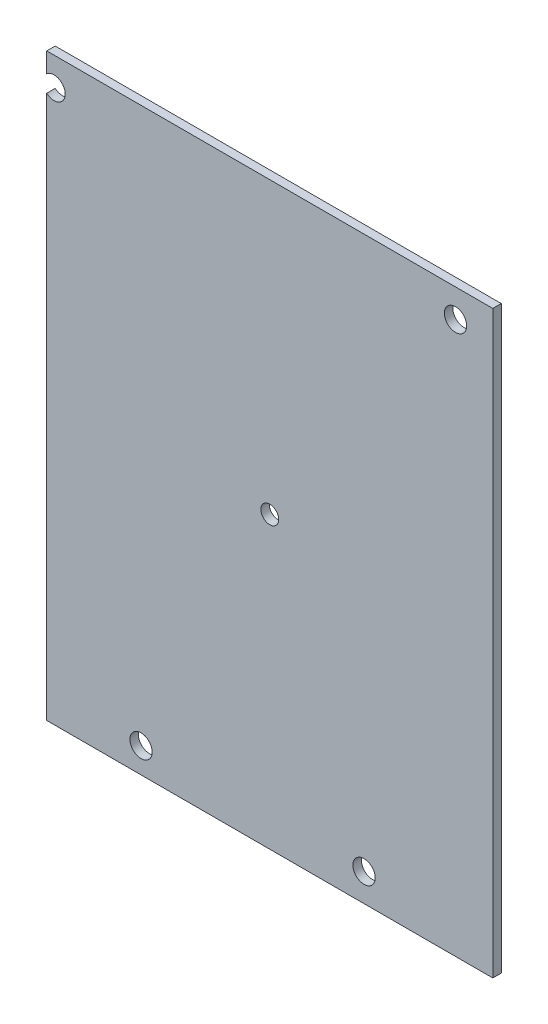
ISO-10303-21;
HEADER;
FILE_DESCRIPTION(('STEP AP214'),'2;1');
FILE_NAME('part.step','',(''),(''),'','','');
FILE_SCHEMA(('AUTOMOTIVE_DESIGN { 1 0 10303 214 1 1 1 1 }'));
ENDSEC;
DATA;
#1=APPLICATION_CONTEXT('core data for automotive mechanical design processes');
#2=APPLICATION_PROTOCOL_DEFINITION('international standard','automotive_design',2000,#1);
#3=PRODUCT_CONTEXT('',#1,'mechanical');
#4=PRODUCT('Part','Part','',(#3));
#5=PRODUCT_RELATED_PRODUCT_CATEGORY('part','',(#4));
#6=PRODUCT_DEFINITION_FORMATION('','',#4);
#7=PRODUCT_DEFINITION_CONTEXT('part definition',#1,'design');
#8=PRODUCT_DEFINITION('design','',#6,#7);
#9=PRODUCT_DEFINITION_SHAPE('','',#8);
#10=(LENGTH_UNIT() NAMED_UNIT(*) SI_UNIT(.MILLI.,.METRE.));
#11=(NAMED_UNIT(*) PLANE_ANGLE_UNIT() SI_UNIT($,.RADIAN.));
#12=(NAMED_UNIT(*) SI_UNIT($,.STERADIAN.) SOLID_ANGLE_UNIT());
#13=UNCERTAINTY_MEASURE_WITH_UNIT(LENGTH_MEASURE(1.E-05),#10,'distance_accuracy_value','');
#14=(GEOMETRIC_REPRESENTATION_CONTEXT(3) GLOBAL_UNCERTAINTY_ASSIGNED_CONTEXT((#13)) GLOBAL_UNIT_ASSIGNED_CONTEXT((#10,
#11,#12)) REPRESENTATION_CONTEXT('',''));
#15=CARTESIAN_POINT('',(0.,0.,0.));
#16=DIRECTION('',(0.,0.,1.));
#17=DIRECTION('',(1.,0.,0.));
#18=AXIS2_PLACEMENT_3D('',#15,#16,#17);
#19=CARTESIAN_POINT('',(0.,0.,-1.89738));
#20=DIRECTION('',(0.,0.,1.));
#21=DIRECTION('',(1.,0.,0.));
#22=AXIS2_PLACEMENT_3D('',#19,#20,#21);
#23=PLANE('',#22);
#24=CARTESIAN_POINT('',(-14.6334496466707,-49.8264548686527,-1.89738));
#25=DIRECTION('',(0.,0.,1.));
#26=DIRECTION('',(1.,0.,0.));
#27=AXIS2_PLACEMENT_3D('',#24,#25,#26);
#28=CIRCLE('',#27,2.5);
#29=CARTESIAN_POINT('',(-12.1334496466707,-49.8264548686527,-1.89738));
#30=VERTEX_POINT('',#29);
#31=EDGE_CURVE('E151',#30,#30,#28,.T.);
#32=ORIENTED_EDGE('',*,*,#31,.T.);
#33=EDGE_LOOP('',(#32));
#34=FACE_BOUND('',#33,.T.);
#35=CARTESIAN_POINT('',(55.8665503533293,68.1735451313474,-1.89738));
#36=DIRECTION('',(0.,0.,1.));
#37=DIRECTION('',(1.,0.,0.));
#38=AXIS2_PLACEMENT_3D('',#35,#36,#37);
#39=CIRCLE('',#38,2.5);
#40=CARTESIAN_POINT('',(58.3665503533293,68.1735451313474,-1.89738));
#41=VERTEX_POINT('',#40);
#42=EDGE_CURVE('E140',#41,#41,#39,.T.);
#43=ORIENTED_EDGE('',*,*,#42,.T.);
#44=EDGE_LOOP('',(#43));
#45=FACE_BOUND('',#44,.T.);
#46=CARTESIAN_POINT('',(-34.1334496466707,68.1735451313474,-1.89738));
#47=DIRECTION('',(0.,0.,1.));
#48=DIRECTION('',(1.,0.,0.));
#49=AXIS2_PLACEMENT_3D('',#46,#47,#48);
#50=CIRCLE('',#49,2.5);
#51=CARTESIAN_POINT('',(-35.7776059019718,66.2902633658768,-1.89738));
#52=VERTEX_POINT('',#51);
#53=CARTESIAN_POINT('',(-35.7776059019718,70.0568268968181,-1.89738));
#54=VERTEX_POINT('',#53);
#55=EDGE_CURVE('E102',#52,#54,#50,.T.);
#56=ORIENTED_EDGE('',*,*,#55,.T.);
#57=DIRECTION('',(0.,-1.,0.));
#58=VECTOR('',#57,1.);
#59=CARTESIAN_POINT('',(-35.7776059019718,74.5093800668341,-1.89738));
#60=LINE('',#59,#58);
#61=CARTESIAN_POINT('',(-35.7776059019718,74.5093800668341,-1.89738));
#62=VERTEX_POINT('',#61);
#63=EDGE_CURVE('E107',#62,#54,#60,.T.);
#64=ORIENTED_EDGE('',*,*,#63,.F.);
#65=DIRECTION('',(-1.,0.,0.));
#66=VECTOR('',#65,1.);
#67=CARTESIAN_POINT('',(-35.7776059019718,74.5093800668341,-1.89738));
#68=LINE('',#67,#66);
#69=CARTESIAN_POINT('',(64.2223940980282,74.5093800668341,-1.89738));
#70=VERTEX_POINT('',#69);
#71=EDGE_CURVE('E120',#70,#62,#68,.T.);
#72=ORIENTED_EDGE('',*,*,#71,.F.);
#73=DIRECTION('',(0.,1.,0.));
#74=VECTOR('',#73,1.);
#75=CARTESIAN_POINT('',(64.2223940980282,74.5093800668341,-1.89738));
#76=LINE('',#75,#74);
#77=CARTESIAN_POINT('',(64.2223940980282,-55.4906199331659,-1.89738));
#78=VERTEX_POINT('',#77);
#79=EDGE_CURVE('E130',#78,#70,#76,.T.);
#80=ORIENTED_EDGE('',*,*,#79,.F.);
#81=DIRECTION('',(1.,0.,0.));
#82=VECTOR('',#81,1.);
#83=CARTESIAN_POINT('',(-35.7776059019718,-55.4906199331659,-1.89738));
#84=LINE('',#83,#82);
#85=CARTESIAN_POINT('',(-35.7776059019718,-55.4906199331659,-1.89738));
#86=VERTEX_POINT('',#85);
#87=EDGE_CURVE('E133',#86,#78,#84,.T.);
#88=ORIENTED_EDGE('',*,*,#87,.F.);
#89=EDGE_CURVE('E85',#52,#86,#60,.T.);
#90=ORIENTED_EDGE('',*,*,#89,.F.);
#91=EDGE_LOOP('',(#56,#64,#72,#80,#88,#90));
#92=FACE_BOUND('',#91,.T.);
#93=CARTESIAN_POINT('',(35.3631866927861,-49.246493887115,-1.89738));
#94=DIRECTION('',(0.,0.,1.));
#95=DIRECTION('',(1.,0.,0.));
#96=AXIS2_PLACEMENT_3D('',#93,#94,#95);
#97=CIRCLE('',#96,2.5);
#98=CARTESIAN_POINT('',(37.8631866927861,-49.246493887115,-1.89738));
#99=VERTEX_POINT('',#98);
#100=EDGE_CURVE('E145',#99,#99,#97,.T.);
#101=ORIENTED_EDGE('',*,*,#100,.T.);
#102=EDGE_LOOP('',(#101));
#103=FACE_BOUND('',#102,.T.);
#104=CARTESIAN_POINT('',(14.2223940980282,9.50938006683406,-1.89738));
#105=DIRECTION('',(0.,0.,1.));
#106=DIRECTION('',(1.,0.,0.));
#107=AXIS2_PLACEMENT_3D('',#104,#105,#106);
#108=CIRCLE('',#107,2.);
#109=CARTESIAN_POINT('',(16.2223940980282,9.50938006683406,-1.89738));
#110=VERTEX_POINT('',#109);
#111=EDGE_CURVE('E157',#110,#110,#108,.T.);
#112=ORIENTED_EDGE('',*,*,#111,.T.);
#113=EDGE_LOOP('',(#112));
#114=FACE_BOUND('',#113,.T.);
#115=ADVANCED_FACE('F35',(#34,#45,#92,#103,#114),#23,.F.);
#116=CARTESIAN_POINT('',(0.,0.,0.));
#117=DIRECTION('',(0.,0.,1.));
#118=DIRECTION('',(1.,0.,0.));
#119=AXIS2_PLACEMENT_3D('',#116,#117,#118);
#120=PLANE('',#119);
#121=CARTESIAN_POINT('',(-14.6334496466707,-49.8264548686527,0.));
#122=DIRECTION('',(0.,0.,1.));
#123=DIRECTION('',(1.,0.,0.));
#124=AXIS2_PLACEMENT_3D('',#121,#122,#123);
#125=CIRCLE('',#124,2.5);
#126=CARTESIAN_POINT('',(-12.1334496466707,-49.8264548686527,0.));
#127=VERTEX_POINT('',#126);
#128=EDGE_CURVE('E154',#127,#127,#125,.T.);
#129=ORIENTED_EDGE('',*,*,#128,.F.);
#130=EDGE_LOOP('',(#129));
#131=FACE_BOUND('',#130,.T.);
#132=CARTESIAN_POINT('',(55.8665503533293,68.1735451313474,0.));
#133=DIRECTION('',(0.,0.,1.));
#134=DIRECTION('',(1.,0.,0.));
#135=AXIS2_PLACEMENT_3D('',#132,#133,#134);
#136=CIRCLE('',#135,2.5);
#137=CARTESIAN_POINT('',(58.3665503533293,68.1735451313474,0.));
#138=VERTEX_POINT('',#137);
#139=EDGE_CURVE('E142',#138,#138,#136,.T.);
#140=ORIENTED_EDGE('',*,*,#139,.F.);
#141=EDGE_LOOP('',(#140));
#142=FACE_BOUND('',#141,.T.);
#143=DIRECTION('',(0.,-1.,0.));
#144=VECTOR('',#143,1.);
#145=CARTESIAN_POINT('',(-35.7776059019718,74.5093800668341,0.));
#146=LINE('',#145,#144);
#147=CARTESIAN_POINT('',(-35.7776059019718,74.5093800668341,0.));
#148=VERTEX_POINT('',#147);
#149=CARTESIAN_POINT('',(-35.7776059019718,70.0568268968181,0.));
#150=VERTEX_POINT('',#149);
#151=EDGE_CURVE('E105',#148,#150,#146,.T.);
#152=ORIENTED_EDGE('',*,*,#151,.T.);
#153=CARTESIAN_POINT('',(-34.1334496466707,68.1735451313474,0.));
#154=DIRECTION('',(0.,0.,1.));
#155=DIRECTION('',(1.,0.,0.));
#156=AXIS2_PLACEMENT_3D('',#153,#154,#155);
#157=CIRCLE('',#156,2.5);
#158=CARTESIAN_POINT('',(-35.7776059019718,66.2902633658768,0.));
#159=VERTEX_POINT('',#158);
#160=EDGE_CURVE('E94',#159,#150,#157,.T.);
#161=ORIENTED_EDGE('',*,*,#160,.F.);
#162=CARTESIAN_POINT('',(-35.7776059019718,-55.4906199331659,0.));
#163=VERTEX_POINT('',#162);
#164=EDGE_CURVE('E108',#159,#163,#146,.T.);
#165=ORIENTED_EDGE('',*,*,#164,.T.);
#166=DIRECTION('',(1.,0.,0.));
#167=VECTOR('',#166,1.);
#168=CARTESIAN_POINT('',(-35.7776059019718,-55.4906199331659,0.));
#169=LINE('',#168,#167);
#170=CARTESIAN_POINT('',(64.2223940980282,-55.4906199331659,0.));
#171=VERTEX_POINT('',#170);
#172=EDGE_CURVE('E114',#163,#171,#169,.T.);
#173=ORIENTED_EDGE('',*,*,#172,.T.);
#174=DIRECTION('',(0.,1.,0.));
#175=VECTOR('',#174,1.);
#176=CARTESIAN_POINT('',(64.2223940980282,74.5093800668341,0.));
#177=LINE('',#176,#175);
#178=CARTESIAN_POINT('',(64.2223940980282,74.5093800668341,0.));
#179=VERTEX_POINT('',#178);
#180=EDGE_CURVE('E117',#171,#179,#177,.T.);
#181=ORIENTED_EDGE('',*,*,#180,.T.);
#182=DIRECTION('',(-1.,0.,0.));
#183=VECTOR('',#182,1.);
#184=CARTESIAN_POINT('',(-35.7776059019718,74.5093800668341,0.));
#185=LINE('',#184,#183);
#186=EDGE_CURVE('E113',#179,#148,#185,.T.);
#187=ORIENTED_EDGE('',*,*,#186,.T.);
#188=EDGE_LOOP('',(#152,#161,#165,#173,#181,#187));
#189=FACE_BOUND('',#188,.T.);
#190=CARTESIAN_POINT('',(35.3631866927861,-49.246493887115,0.));
#191=DIRECTION('',(0.,0.,1.));
#192=DIRECTION('',(1.,0.,0.));
#193=AXIS2_PLACEMENT_3D('',#190,#191,#192);
#194=CIRCLE('',#193,2.5);
#195=CARTESIAN_POINT('',(37.8631866927861,-49.246493887115,0.));
#196=VERTEX_POINT('',#195);
#197=EDGE_CURVE('E148',#196,#196,#194,.T.);
#198=ORIENTED_EDGE('',*,*,#197,.F.);
#199=EDGE_LOOP('',(#198));
#200=FACE_BOUND('',#199,.T.);
#201=CARTESIAN_POINT('',(14.2223940980282,9.50938006683406,0.));
#202=DIRECTION('',(0.,0.,1.));
#203=DIRECTION('',(1.,0.,0.));
#204=AXIS2_PLACEMENT_3D('',#201,#202,#203);
#205=CIRCLE('',#204,2.);
#206=CARTESIAN_POINT('',(16.2223940980282,9.50938006683406,0.));
#207=VERTEX_POINT('',#206);
#208=EDGE_CURVE('E160',#207,#207,#205,.T.);
#209=ORIENTED_EDGE('',*,*,#208,.F.);
#210=EDGE_LOOP('',(#209));
#211=FACE_BOUND('',#210,.T.);
#212=ADVANCED_FACE('F110',(#131,#142,#189,#200,#211),#120,.T.);
#213=CARTESIAN_POINT('',(-35.7776059019718,74.5093800668341,-1.89738));
#214=DIRECTION('',(-1.,0.,0.));
#215=DIRECTION('',(0.,-1.,0.));
#216=AXIS2_PLACEMENT_3D('',#213,#214,#215);
#217=PLANE('',#216);
#218=ORIENTED_EDGE('',*,*,#164,.F.);
#219=DIRECTION('',(0.,0.,-1.));
#220=VECTOR('',#219,1.);
#221=CARTESIAN_POINT('',(-35.7776059019718,66.2902633658768,-1.89738));
#222=LINE('',#221,#220);
#223=EDGE_CURVE('E52',#52,#159,#222,.F.);
#224=ORIENTED_EDGE('',*,*,#223,.F.);
#225=ORIENTED_EDGE('',*,*,#89,.T.);
#226=DIRECTION('',(0.,0.,1.));
#227=VECTOR('',#226,1.);
#228=CARTESIAN_POINT('',(-35.7776059019718,-55.4906199331659,-1.89738));
#229=LINE('',#228,#227);
#230=EDGE_CURVE('E39',#86,#163,#229,.T.);
#231=ORIENTED_EDGE('',*,*,#230,.T.);
#232=EDGE_LOOP('',(#218,#224,#225,#231));
#233=FACE_BOUND('',#232,.T.);
#234=ADVANCED_FACE('F37',(#233),#217,.T.);
#235=ORIENTED_EDGE('',*,*,#63,.T.);
#236=DIRECTION('',(0.,0.,-1.));
#237=VECTOR('',#236,1.);
#238=CARTESIAN_POINT('',(-35.7776059019718,70.0568268968181,-1.89738));
#239=LINE('',#238,#237);
#240=EDGE_CURVE('E97',#54,#150,#239,.F.);
#241=ORIENTED_EDGE('',*,*,#240,.T.);
#242=ORIENTED_EDGE('',*,*,#151,.F.);
#243=DIRECTION('',(0.,0.,1.));
#244=VECTOR('',#243,1.);
#245=CARTESIAN_POINT('',(-35.7776059019718,74.5093800668341,-1.89738));
#246=LINE('',#245,#244);
#247=EDGE_CURVE('E11',#62,#148,#246,.T.);
#248=ORIENTED_EDGE('',*,*,#247,.F.);
#249=EDGE_LOOP('',(#235,#241,#242,#248));
#250=FACE_BOUND('',#249,.T.);
#251=ADVANCED_FACE('F104',(#250),#217,.T.);
#252=CARTESIAN_POINT('',(-35.7776059019718,74.5093800668341,-1.89738));
#253=DIRECTION('',(0.,1.,0.));
#254=DIRECTION('',(0.,0.,1.));
#255=AXIS2_PLACEMENT_3D('',#252,#253,#254);
#256=PLANE('',#255);
#257=ORIENTED_EDGE('',*,*,#186,.F.);
#258=DIRECTION('',(0.,0.,1.));
#259=VECTOR('',#258,1.);
#260=CARTESIAN_POINT('',(64.2223940980282,74.5093800668341,-1.89738));
#261=LINE('',#260,#259);
#262=EDGE_CURVE('E44',#70,#179,#261,.T.);
#263=ORIENTED_EDGE('',*,*,#262,.F.);
#264=ORIENTED_EDGE('',*,*,#71,.T.);
#265=ORIENTED_EDGE('',*,*,#247,.T.);
#266=EDGE_LOOP('',(#257,#263,#264,#265));
#267=FACE_BOUND('',#266,.T.);
#268=ADVANCED_FACE('F187',(#267),#256,.T.);
#269=CARTESIAN_POINT('',(64.2223940980282,74.5093800668341,-1.89738));
#270=DIRECTION('',(1.,0.,0.));
#271=DIRECTION('',(0.,1.,0.));
#272=AXIS2_PLACEMENT_3D('',#269,#270,#271);
#273=PLANE('',#272);
#274=ORIENTED_EDGE('',*,*,#180,.F.);
#275=DIRECTION('',(0.,0.,1.));
#276=VECTOR('',#275,1.);
#277=CARTESIAN_POINT('',(64.2223940980282,-55.4906199331659,-1.89738));
#278=LINE('',#277,#276);
#279=EDGE_CURVE('E125',#78,#171,#278,.T.);
#280=ORIENTED_EDGE('',*,*,#279,.F.);
#281=ORIENTED_EDGE('',*,*,#79,.T.);
#282=ORIENTED_EDGE('',*,*,#262,.T.);
#283=EDGE_LOOP('',(#274,#280,#281,#282));
#284=FACE_BOUND('',#283,.T.);
#285=ADVANCED_FACE('F190',(#284),#273,.T.);
#286=CARTESIAN_POINT('',(-35.7776059019718,-55.4906199331659,-1.89738));
#287=DIRECTION('',(0.,-1.,0.));
#288=DIRECTION('',(0.,0.,-1.));
#289=AXIS2_PLACEMENT_3D('',#286,#287,#288);
#290=PLANE('',#289);
#291=ORIENTED_EDGE('',*,*,#172,.F.);
#292=ORIENTED_EDGE('',*,*,#230,.F.);
#293=ORIENTED_EDGE('',*,*,#87,.T.);
#294=ORIENTED_EDGE('',*,*,#279,.T.);
#295=EDGE_LOOP('',(#291,#292,#293,#294));
#296=FACE_BOUND('',#295,.T.);
#297=ADVANCED_FACE('F192',(#296),#290,.T.);
#298=CARTESIAN_POINT('',(-34.1334496466707,68.1735451313474,-1.89738));
#299=DIRECTION('',(0.,0.,1.));
#300=DIRECTION('',(1.,0.,0.));
#301=AXIS2_PLACEMENT_3D('',#298,#299,#300);
#302=CYLINDRICAL_SURFACE('',#301,2.5);
#303=ORIENTED_EDGE('',*,*,#240,.F.);
#304=ORIENTED_EDGE('',*,*,#55,.F.);
#305=ORIENTED_EDGE('',*,*,#223,.T.);
#306=ORIENTED_EDGE('',*,*,#160,.T.);
#307=EDGE_LOOP('',(#303,#304,#305,#306));
#308=FACE_BOUND('',#307,.T.);
#309=ADVANCED_FACE('F96',(#308),#302,.F.);
#310=CARTESIAN_POINT('',(55.8665503533293,68.1735451313474,0.));
#311=DIRECTION('',(0.,0.,1.));
#312=DIRECTION('',(1.,0.,0.));
#313=AXIS2_PLACEMENT_3D('',#310,#311,#312);
#314=CYLINDRICAL_SURFACE('',#313,2.5);
#315=ORIENTED_EDGE('',*,*,#42,.F.);
#316=EDGE_LOOP('',(#315));
#317=FACE_BOUND('',#316,.T.);
#318=ORIENTED_EDGE('',*,*,#139,.T.);
#319=EDGE_LOOP('',(#318));
#320=FACE_BOUND('',#319,.T.);
#321=ADVANCED_FACE('F197',(#317,#320),#314,.F.);
#322=CARTESIAN_POINT('',(35.3631866927861,-49.246493887115,0.));
#323=DIRECTION('',(0.,0.,1.));
#324=DIRECTION('',(1.,0.,0.));
#325=AXIS2_PLACEMENT_3D('',#322,#323,#324);
#326=CYLINDRICAL_SURFACE('',#325,2.5);
#327=ORIENTED_EDGE('',*,*,#100,.F.);
#328=EDGE_LOOP('',(#327));
#329=FACE_BOUND('',#328,.T.);
#330=ORIENTED_EDGE('',*,*,#197,.T.);
#331=EDGE_LOOP('',(#330));
#332=FACE_BOUND('',#331,.T.);
#333=ADVANCED_FACE('F203',(#329,#332),#326,.F.);
#334=CARTESIAN_POINT('',(-14.6334496466707,-49.8264548686527,0.));
#335=DIRECTION('',(0.,0.,1.));
#336=DIRECTION('',(1.,0.,0.));
#337=AXIS2_PLACEMENT_3D('',#334,#335,#336);
#338=CYLINDRICAL_SURFACE('',#337,2.5);
#339=ORIENTED_EDGE('',*,*,#31,.F.);
#340=EDGE_LOOP('',(#339));
#341=FACE_BOUND('',#340,.T.);
#342=ORIENTED_EDGE('',*,*,#128,.T.);
#343=EDGE_LOOP('',(#342));
#344=FACE_BOUND('',#343,.T.);
#345=ADVANCED_FACE('F170',(#341,#344),#338,.F.);
#346=CARTESIAN_POINT('',(14.2223940980282,9.50938006683406,0.));
#347=DIRECTION('',(0.,0.,1.));
#348=DIRECTION('',(1.,0.,0.));
#349=AXIS2_PLACEMENT_3D('',#346,#347,#348);
#350=CYLINDRICAL_SURFACE('',#349,2.);
#351=ORIENTED_EDGE('',*,*,#111,.F.);
#352=EDGE_LOOP('',(#351));
#353=FACE_BOUND('',#352,.T.);
#354=ORIENTED_EDGE('',*,*,#208,.T.);
#355=EDGE_LOOP('',(#354));
#356=FACE_BOUND('',#355,.T.);
#357=ADVANCED_FACE('F167',(#353,#356),#350,.F.);
#358=CLOSED_SHELL('',(#115,#212,#234,#251,#268,#285,#297,#309,#321,#333,#345,#357));
#359=MANIFOLD_SOLID_BREP('B2',#358);
#360=ADVANCED_BREP_SHAPE_REPRESENTATION('',(#18,#359),#14);
#361=SHAPE_DEFINITION_REPRESENTATION(#9,#360);
ENDSEC;
END-ISO-10303-21;
